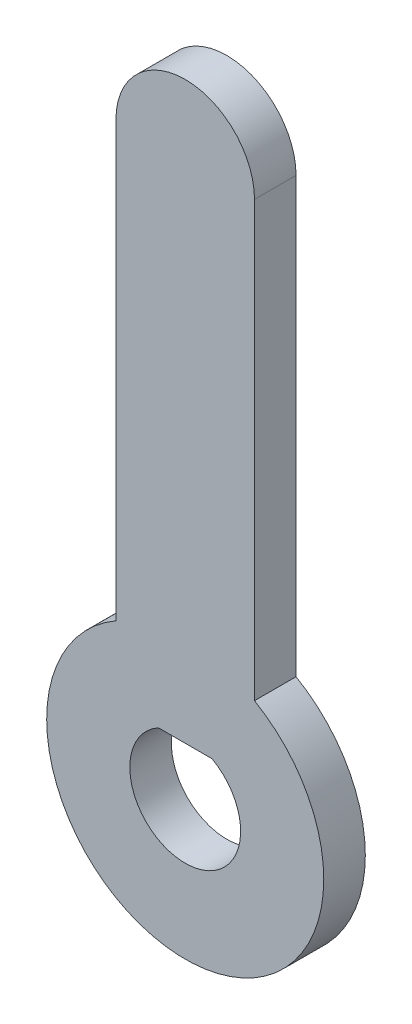
ISO-10303-21;
HEADER;
FILE_DESCRIPTION(('STEP AP214'),'2;1');
FILE_NAME('part.step','',(''),(''),'','','');
FILE_SCHEMA(('AUTOMOTIVE_DESIGN { 1 0 10303 214 1 1 1 1 }'));
ENDSEC;
DATA;
#1=APPLICATION_CONTEXT('core data for automotive mechanical design processes');
#2=APPLICATION_PROTOCOL_DEFINITION('international standard','automotive_design',2000,#1);
#3=PRODUCT_CONTEXT('',#1,'mechanical');
#4=PRODUCT('Part','Part','',(#3));
#5=PRODUCT_RELATED_PRODUCT_CATEGORY('part','',(#4));
#6=PRODUCT_DEFINITION_FORMATION('','',#4);
#7=PRODUCT_DEFINITION_CONTEXT('part definition',#1,'design');
#8=PRODUCT_DEFINITION('design','',#6,#7);
#9=PRODUCT_DEFINITION_SHAPE('','',#8);
#10=(LENGTH_UNIT() NAMED_UNIT(*) SI_UNIT(.MILLI.,.METRE.));
#11=(NAMED_UNIT(*) PLANE_ANGLE_UNIT() SI_UNIT($,.RADIAN.));
#12=(NAMED_UNIT(*) SI_UNIT($,.STERADIAN.) SOLID_ANGLE_UNIT());
#13=UNCERTAINTY_MEASURE_WITH_UNIT(LENGTH_MEASURE(1.E-05),#10,'distance_accuracy_value','');
#14=(GEOMETRIC_REPRESENTATION_CONTEXT(3) GLOBAL_UNCERTAINTY_ASSIGNED_CONTEXT((#13)) GLOBAL_UNIT_ASSIGNED_CONTEXT((#10,
#11,#12)) REPRESENTATION_CONTEXT('',''));
#15=CARTESIAN_POINT('',(0.,0.,0.));
#16=DIRECTION('',(0.,0.,1.));
#17=DIRECTION('',(1.,0.,0.));
#18=AXIS2_PLACEMENT_3D('',#15,#16,#17);
#19=CARTESIAN_POINT('',(0.,40.,3.));
#20=DIRECTION('',(0.,0.,-1.));
#21=DIRECTION('',(-1.,0.,0.));
#22=AXIS2_PLACEMENT_3D('',#19,#20,#21);
#23=CYLINDRICAL_SURFACE('',#22,5.);
#24=CARTESIAN_POINT('',(0.,40.,0.));
#25=DIRECTION('',(0.,0.,1.));
#26=DIRECTION('',(1.,0.,0.));
#27=AXIS2_PLACEMENT_3D('',#24,#25,#26);
#28=CIRCLE('',#27,5.);
#29=CARTESIAN_POINT('',(5.,40.,0.));
#30=VERTEX_POINT('',#29);
#31=CARTESIAN_POINT('',(-5.,40.,0.));
#32=VERTEX_POINT('',#31);
#33=EDGE_CURVE('E99',#30,#32,#28,.T.);
#34=ORIENTED_EDGE('',*,*,#33,.T.);
#35=DIRECTION('',(0.,0.,-1.));
#36=VECTOR('',#35,1.);
#37=CARTESIAN_POINT('',(-5.,40.,3.));
#38=LINE('',#37,#36);
#39=CARTESIAN_POINT('',(-5.,40.,3.));
#40=VERTEX_POINT('',#39);
#41=EDGE_CURVE('E11',#40,#32,#38,.T.);
#42=ORIENTED_EDGE('',*,*,#41,.F.);
#43=CARTESIAN_POINT('',(0.,40.,3.));
#44=DIRECTION('',(0.,0.,1.));
#45=DIRECTION('',(1.,0.,0.));
#46=AXIS2_PLACEMENT_3D('',#43,#44,#45);
#47=CIRCLE('',#46,5.);
#48=CARTESIAN_POINT('',(5.,40.,3.));
#49=VERTEX_POINT('',#48);
#50=EDGE_CURVE('E101',#49,#40,#47,.T.);
#51=ORIENTED_EDGE('',*,*,#50,.F.);
#52=DIRECTION('',(0.,0.,-1.));
#53=VECTOR('',#52,1.);
#54=CARTESIAN_POINT('',(5.,40.,3.));
#55=LINE('',#54,#53);
#56=EDGE_CURVE('E111',#49,#30,#55,.T.);
#57=ORIENTED_EDGE('',*,*,#56,.T.);
#58=EDGE_LOOP('',(#34,#42,#51,#57));
#59=FACE_BOUND('',#58,.T.);
#60=ADVANCED_FACE('F31',(#59),#23,.T.);
#61=CARTESIAN_POINT('',(-5.,8.66025403784439,3.));
#62=DIRECTION('',(1.,0.,0.));
#63=DIRECTION('',(0.,0.,-1.));
#64=AXIS2_PLACEMENT_3D('',#61,#62,#63);
#65=PLANE('',#64);
#66=DIRECTION('',(0.,-1.,0.));
#67=VECTOR('',#66,1.);
#68=CARTESIAN_POINT('',(-5.,8.66025403784439,0.));
#69=LINE('',#68,#67);
#70=CARTESIAN_POINT('',(-5.,8.66025403784439,0.));
#71=VERTEX_POINT('',#70);
#72=EDGE_CURVE('E114',#32,#71,#69,.T.);
#73=ORIENTED_EDGE('',*,*,#72,.T.);
#74=DIRECTION('',(0.,0.,-1.));
#75=VECTOR('',#74,1.);
#76=CARTESIAN_POINT('',(-5.,8.66025403784439,3.));
#77=LINE('',#76,#75);
#78=CARTESIAN_POINT('',(-5.,8.66025403784439,3.));
#79=VERTEX_POINT('',#78);
#80=EDGE_CURVE('E38',#79,#71,#77,.T.);
#81=ORIENTED_EDGE('',*,*,#80,.F.);
#82=DIRECTION('',(0.,-1.,0.));
#83=VECTOR('',#82,1.);
#84=CARTESIAN_POINT('',(-5.,8.66025403784439,3.));
#85=LINE('',#84,#83);
#86=EDGE_CURVE('E104',#40,#79,#85,.T.);
#87=ORIENTED_EDGE('',*,*,#86,.F.);
#88=ORIENTED_EDGE('',*,*,#41,.T.);
#89=EDGE_LOOP('',(#73,#81,#87,#88));
#90=FACE_BOUND('',#89,.T.);
#91=ADVANCED_FACE('F142',(#90),#65,.F.);
#92=CARTESIAN_POINT('',(0.,0.,3.));
#93=DIRECTION('',(0.,0.,-1.));
#94=DIRECTION('',(-1.,0.,0.));
#95=AXIS2_PLACEMENT_3D('',#92,#93,#94);
#96=CYLINDRICAL_SURFACE('',#95,10.);
#97=CARTESIAN_POINT('',(0.,0.,0.));
#98=DIRECTION('',(0.,0.,1.));
#99=DIRECTION('',(1.,0.,0.));
#100=AXIS2_PLACEMENT_3D('',#97,#98,#99);
#101=CIRCLE('',#100,10.);
#102=CARTESIAN_POINT('',(5.,8.66025403784439,0.));
#103=VERTEX_POINT('',#102);
#104=EDGE_CURVE('E116',#71,#103,#101,.T.);
#105=ORIENTED_EDGE('',*,*,#104,.T.);
#106=DIRECTION('',(0.,0.,-1.));
#107=VECTOR('',#106,1.);
#108=CARTESIAN_POINT('',(5.,8.66025403784439,3.));
#109=LINE('',#108,#107);
#110=CARTESIAN_POINT('',(5.,8.66025403784439,3.));
#111=VERTEX_POINT('',#110);
#112=EDGE_CURVE('E121',#111,#103,#109,.T.);
#113=ORIENTED_EDGE('',*,*,#112,.F.);
#114=CARTESIAN_POINT('',(0.,0.,3.));
#115=DIRECTION('',(0.,0.,1.));
#116=DIRECTION('',(1.,0.,0.));
#117=AXIS2_PLACEMENT_3D('',#114,#115,#116);
#118=CIRCLE('',#117,10.);
#119=EDGE_CURVE('E107',#79,#111,#118,.T.);
#120=ORIENTED_EDGE('',*,*,#119,.F.);
#121=ORIENTED_EDGE('',*,*,#80,.T.);
#122=EDGE_LOOP('',(#105,#113,#120,#121));
#123=FACE_BOUND('',#122,.T.);
#124=ADVANCED_FACE('F128',(#123),#96,.T.);
#125=CARTESIAN_POINT('',(5.,8.66025403784439,3.));
#126=DIRECTION('',(-1.,0.,0.));
#127=DIRECTION('',(0.,0.,1.));
#128=AXIS2_PLACEMENT_3D('',#125,#126,#127);
#129=PLANE('',#128);
#130=DIRECTION('',(0.,1.,0.));
#131=VECTOR('',#130,1.);
#132=CARTESIAN_POINT('',(5.,8.66025403784439,0.));
#133=LINE('',#132,#131);
#134=EDGE_CURVE('E105',#103,#30,#133,.T.);
#135=ORIENTED_EDGE('',*,*,#134,.T.);
#136=ORIENTED_EDGE('',*,*,#56,.F.);
#137=DIRECTION('',(0.,1.,0.));
#138=VECTOR('',#137,1.);
#139=CARTESIAN_POINT('',(5.,8.66025403784439,3.));
#140=LINE('',#139,#138);
#141=EDGE_CURVE('E109',#111,#49,#140,.T.);
#142=ORIENTED_EDGE('',*,*,#141,.F.);
#143=ORIENTED_EDGE('',*,*,#112,.T.);
#144=EDGE_LOOP('',(#135,#136,#142,#143));
#145=FACE_BOUND('',#144,.T.);
#146=ADVANCED_FACE('F135',(#145),#129,.F.);
#147=CARTESIAN_POINT('',(0.,40.,3.));
#148=DIRECTION('',(0.,0.,1.));
#149=DIRECTION('',(1.,0.,0.));
#150=AXIS2_PLACEMENT_3D('',#147,#148,#149);
#151=PLANE('',#150);
#152=CARTESIAN_POINT('',(0.,0.,3.));
#153=DIRECTION('',(0.,0.,1.));
#154=DIRECTION('',(1.,0.,0.));
#155=AXIS2_PLACEMENT_3D('',#152,#153,#154);
#156=CIRCLE('',#155,4.);
#157=CARTESIAN_POINT('',(-1.93649167310371,3.5,3.));
#158=VERTEX_POINT('',#157);
#159=CARTESIAN_POINT('',(1.93649167310371,3.5,3.));
#160=VERTEX_POINT('',#159);
#161=EDGE_CURVE('E45',#158,#160,#156,.T.);
#162=ORIENTED_EDGE('',*,*,#161,.F.);
#163=DIRECTION('',(-1.,0.,0.));
#164=VECTOR('',#163,1.);
#165=CARTESIAN_POINT('',(-1.93649167310371,3.5,3.));
#166=LINE('',#165,#164);
#167=EDGE_CURVE('E94',#160,#158,#166,.T.);
#168=ORIENTED_EDGE('',*,*,#167,.F.);
#169=EDGE_LOOP('',(#162,#168));
#170=FACE_BOUND('',#169,.T.);
#171=ORIENTED_EDGE('',*,*,#50,.T.);
#172=ORIENTED_EDGE('',*,*,#86,.T.);
#173=ORIENTED_EDGE('',*,*,#119,.T.);
#174=ORIENTED_EDGE('',*,*,#141,.T.);
#175=EDGE_LOOP('',(#171,#172,#173,#174));
#176=FACE_BOUND('',#175,.T.);
#177=ADVANCED_FACE('F141',(#170,#176),#151,.T.);
#178=CARTESIAN_POINT('',(0.,40.,0.));
#179=DIRECTION('',(0.,0.,1.));
#180=DIRECTION('',(1.,0.,0.));
#181=AXIS2_PLACEMENT_3D('',#178,#179,#180);
#182=PLANE('',#181);
#183=DIRECTION('',(-1.,0.,0.));
#184=VECTOR('',#183,1.);
#185=CARTESIAN_POINT('',(-1.93649167310371,3.5,0.));
#186=LINE('',#185,#184);
#187=CARTESIAN_POINT('',(1.93649167310371,3.5,0.));
#188=VERTEX_POINT('',#187);
#189=CARTESIAN_POINT('',(-1.93649167310371,3.5,0.));
#190=VERTEX_POINT('',#189);
#191=EDGE_CURVE('E86',#188,#190,#186,.T.);
#192=ORIENTED_EDGE('',*,*,#191,.T.);
#193=CARTESIAN_POINT('',(0.,0.,0.));
#194=DIRECTION('',(0.,0.,1.));
#195=DIRECTION('',(1.,0.,0.));
#196=AXIS2_PLACEMENT_3D('',#193,#194,#195);
#197=CIRCLE('',#196,4.);
#198=EDGE_CURVE('E50',#190,#188,#197,.T.);
#199=ORIENTED_EDGE('',*,*,#198,.T.);
#200=EDGE_LOOP('',(#192,#199));
#201=FACE_BOUND('',#200,.T.);
#202=ORIENTED_EDGE('',*,*,#33,.F.);
#203=ORIENTED_EDGE('',*,*,#134,.F.);
#204=ORIENTED_EDGE('',*,*,#104,.F.);
#205=ORIENTED_EDGE('',*,*,#72,.F.);
#206=EDGE_LOOP('',(#202,#203,#204,#205));
#207=FACE_BOUND('',#206,.T.);
#208=ADVANCED_FACE('F92',(#201,#207),#182,.F.);
#209=CARTESIAN_POINT('',(0.,0.,0.));
#210=DIRECTION('',(0.,0.,1.));
#211=DIRECTION('',(1.,0.,0.));
#212=AXIS2_PLACEMENT_3D('',#209,#210,#211);
#213=CYLINDRICAL_SURFACE('',#212,4.);
#214=ORIENTED_EDGE('',*,*,#161,.T.);
#215=DIRECTION('',(0.,0.,1.));
#216=VECTOR('',#215,1.);
#217=CARTESIAN_POINT('',(1.93649167310371,3.5,0.));
#218=LINE('',#217,#216);
#219=EDGE_CURVE('E79',#188,#160,#218,.T.);
#220=ORIENTED_EDGE('',*,*,#219,.F.);
#221=ORIENTED_EDGE('',*,*,#198,.F.);
#222=DIRECTION('',(0.,0.,1.));
#223=VECTOR('',#222,1.);
#224=CARTESIAN_POINT('',(-1.93649167310371,3.5,0.));
#225=LINE('',#224,#223);
#226=EDGE_CURVE('E85',#190,#158,#225,.T.);
#227=ORIENTED_EDGE('',*,*,#226,.T.);
#228=EDGE_LOOP('',(#214,#220,#221,#227));
#229=FACE_BOUND('',#228,.T.);
#230=ADVANCED_FACE('F81',(#229),#213,.F.);
#231=CARTESIAN_POINT('',(-1.93649167310371,3.5,0.));
#232=DIRECTION('',(0.,1.,0.));
#233=DIRECTION('',(0.,0.,1.));
#234=AXIS2_PLACEMENT_3D('',#231,#232,#233);
#235=PLANE('',#234);
#236=ORIENTED_EDGE('',*,*,#167,.T.);
#237=ORIENTED_EDGE('',*,*,#226,.F.);
#238=ORIENTED_EDGE('',*,*,#191,.F.);
#239=ORIENTED_EDGE('',*,*,#219,.T.);
#240=EDGE_LOOP('',(#236,#237,#238,#239));
#241=FACE_BOUND('',#240,.T.);
#242=ADVANCED_FACE('F89',(#241),#235,.F.);
#243=CLOSED_SHELL('',(#60,#91,#124,#146,#177,#208,#230,#242));
#244=MANIFOLD_SOLID_BREP('B2',#243);
#245=ADVANCED_BREP_SHAPE_REPRESENTATION('',(#18,#244),#14);
#246=SHAPE_DEFINITION_REPRESENTATION(#9,#245);
ENDSEC;
END-ISO-10303-21;
